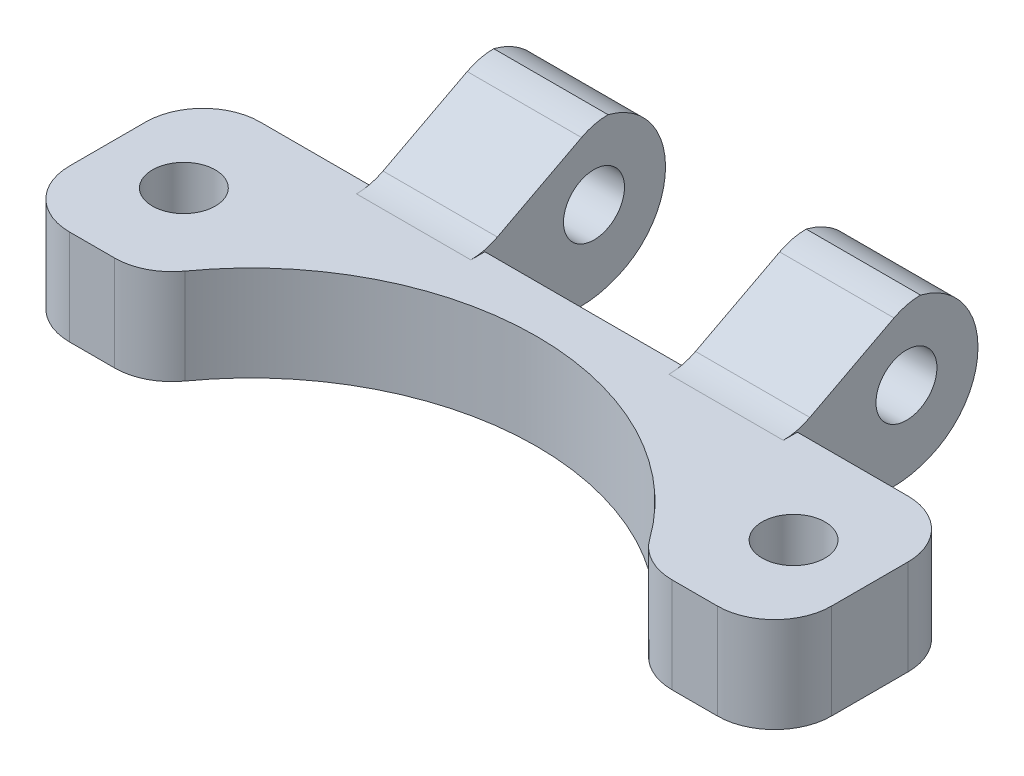
ISO-10303-21;
HEADER;
FILE_DESCRIPTION(('STEP AP214'),'2;1');
FILE_NAME('part.step','',(''),(''),'','','');
FILE_SCHEMA(('AUTOMOTIVE_DESIGN { 1 0 10303 214 1 1 1 1 }'));
ENDSEC;
DATA;
#1=APPLICATION_CONTEXT('core data for automotive mechanical design processes');
#2=APPLICATION_PROTOCOL_DEFINITION('international standard','automotive_design',2000,#1);
#3=PRODUCT_CONTEXT('',#1,'mechanical');
#4=PRODUCT('Part','Part','',(#3));
#5=PRODUCT_RELATED_PRODUCT_CATEGORY('part','',(#4));
#6=PRODUCT_DEFINITION_FORMATION('','',#4);
#7=PRODUCT_DEFINITION_CONTEXT('part definition',#1,'design');
#8=PRODUCT_DEFINITION('design','',#6,#7);
#9=PRODUCT_DEFINITION_SHAPE('','',#8);
#10=(LENGTH_UNIT() NAMED_UNIT(*) SI_UNIT(.MILLI.,.METRE.));
#11=(NAMED_UNIT(*) PLANE_ANGLE_UNIT() SI_UNIT($,.RADIAN.));
#12=(NAMED_UNIT(*) SI_UNIT($,.STERADIAN.) SOLID_ANGLE_UNIT());
#13=UNCERTAINTY_MEASURE_WITH_UNIT(LENGTH_MEASURE(1.E-05),#10,'distance_accuracy_value','');
#14=(GEOMETRIC_REPRESENTATION_CONTEXT(3) GLOBAL_UNCERTAINTY_ASSIGNED_CONTEXT((#13)) GLOBAL_UNIT_ASSIGNED_CONTEXT((#10,
#11,#12)) REPRESENTATION_CONTEXT('',''));
#15=CARTESIAN_POINT('',(0.,0.,0.));
#16=DIRECTION('',(0.,0.,1.));
#17=DIRECTION('',(1.,0.,0.));
#18=AXIS2_PLACEMENT_3D('',#15,#16,#17);
#19=CARTESIAN_POINT('',(-38.8675457158584,5.,2.34427129839153));
#20=DIRECTION('',(0.,0.,-1.));
#21=DIRECTION('',(-1.,0.,0.));
#22=AXIS2_PLACEMENT_3D('',#19,#20,#21);
#23=PLANE('',#22);
#24=DIRECTION('',(1.,0.,0.));
#25=VECTOR('',#24,1.);
#26=CARTESIAN_POINT('',(-38.8675457158584,0.,2.34427129839153));
#27=LINE('',#26,#25);
#28=CARTESIAN_POINT('',(-35.8675457158584,0.,2.34427129839153));
#29=VERTEX_POINT('',#28);
#30=CARTESIAN_POINT('',(-33.4997058898967,0.,2.34427129839153));
#31=VERTEX_POINT('',#30);
#32=EDGE_CURVE('E355',#29,#31,#27,.T.);
#33=ORIENTED_EDGE('',*,*,#32,.T.);
#34=DIRECTION('',(0.,1.,0.));
#35=VECTOR('',#34,1.);
#36=CARTESIAN_POINT('',(-33.4997058898967,5.,2.34427129839153));
#37=LINE('',#36,#35);
#38=CARTESIAN_POINT('',(-33.4997058898967,5.,2.34427129839153));
#39=VERTEX_POINT('',#38);
#40=EDGE_CURVE('E451',#31,#39,#37,.T.);
#41=ORIENTED_EDGE('',*,*,#40,.T.);
#42=DIRECTION('',(1.,0.,0.));
#43=VECTOR('',#42,1.);
#44=CARTESIAN_POINT('',(-38.8675457158584,5.,2.34427129839153));
#45=LINE('',#44,#43);
#46=CARTESIAN_POINT('',(-35.8675457158584,5.,2.34427129839153));
#47=VERTEX_POINT('',#46);
#48=EDGE_CURVE('E368',#47,#39,#45,.T.);
#49=ORIENTED_EDGE('',*,*,#48,.F.);
#50=DIRECTION('',(0.,-1.,0.));
#51=VECTOR('',#50,1.);
#52=CARTESIAN_POINT('',(-35.8675457158584,5.,2.34427129839153));
#53=LINE('',#52,#51);
#54=EDGE_CURVE('E805',#47,#29,#53,.T.);
#55=ORIENTED_EDGE('',*,*,#54,.T.);
#56=EDGE_LOOP('',(#33,#41,#49,#55));
#57=FACE_BOUND('',#56,.T.);
#58=ADVANCED_FACE('F32',(#57),#23,.F.);
#59=CARTESIAN_POINT('',(-38.8675457158584,5.,-7.65572870160847));
#60=DIRECTION('',(0.,0.,1.));
#61=DIRECTION('',(1.,0.,0.));
#62=AXIS2_PLACEMENT_3D('',#59,#60,#61);
#63=PLANE('',#62);
#64=DIRECTION('',(0.,-1.,0.));
#65=VECTOR('',#64,1.);
#66=CARTESIAN_POINT('',(-24.0675457158584,10.,-7.65572870160847));
#67=LINE('',#66,#65);
#68=CARTESIAN_POINT('',(-24.0675457158584,5.,-7.65572870160847));
#69=VERTEX_POINT('',#68);
#70=CARTESIAN_POINT('',(-24.0675457158584,0.,-7.65572870160847));
#71=VERTEX_POINT('',#70);
#72=EDGE_CURVE('E238',#69,#71,#67,.T.);
#73=ORIENTED_EDGE('',*,*,#72,.F.);
#74=DIRECTION('',(-1.,0.,0.));
#75=VECTOR('',#74,1.);
#76=CARTESIAN_POINT('',(-38.8675457158584,5.,-7.65572870160847));
#77=LINE('',#76,#75);
#78=CARTESIAN_POINT('',(-13.6675457158584,5.,-7.65572870160847));
#79=VERTEX_POINT('',#78);
#80=EDGE_CURVE('E364',#79,#69,#77,.T.);
#81=ORIENTED_EDGE('',*,*,#80,.F.);
#82=DIRECTION('',(0.,-1.,0.));
#83=VECTOR('',#82,1.);
#84=CARTESIAN_POINT('',(-13.6675457158584,10.,-7.65572870160847));
#85=LINE('',#84,#83);
#86=CARTESIAN_POINT('',(-13.6675457158584,0.,-7.65572870160847));
#87=VERTEX_POINT('',#86);
#88=EDGE_CURVE('E262',#79,#87,#85,.T.);
#89=ORIENTED_EDGE('',*,*,#88,.T.);
#90=DIRECTION('',(-1.,0.,0.));
#91=VECTOR('',#90,1.);
#92=CARTESIAN_POINT('',(-38.8675457158584,0.,-7.65572870160847));
#93=LINE('',#92,#91);
#94=EDGE_CURVE('E227',#87,#71,#93,.T.);
#95=ORIENTED_EDGE('',*,*,#94,.T.);
#96=EDGE_LOOP('',(#73,#81,#89,#95));
#97=FACE_BOUND('',#96,.T.);
#98=ADVANCED_FACE('F408',(#97),#63,.F.);
#99=CARTESIAN_POINT('',(-30.0675457158584,0.,-7.65572870160847));
#100=VERTEX_POINT('',#99);
#101=CARTESIAN_POINT('',(-35.8675457158584,0.,-7.65572870160847));
#102=VERTEX_POINT('',#101);
#103=EDGE_CURVE('E215',#100,#102,#93,.T.);
#104=ORIENTED_EDGE('',*,*,#103,.T.);
#105=DIRECTION('',(0.,-1.,0.));
#106=VECTOR('',#105,1.);
#107=CARTESIAN_POINT('',(-35.8675457158584,5.,-7.65572870160847));
#108=LINE('',#107,#106);
#109=CARTESIAN_POINT('',(-35.8675457158584,5.,-7.65572870160847));
#110=VERTEX_POINT('',#109);
#111=EDGE_CURVE('E817',#102,#110,#108,.F.);
#112=ORIENTED_EDGE('',*,*,#111,.T.);
#113=CARTESIAN_POINT('',(-30.0675457158584,5.,-7.65572870160847));
#114=VERTEX_POINT('',#113);
#115=EDGE_CURVE('E235',#114,#110,#77,.T.);
#116=ORIENTED_EDGE('',*,*,#115,.F.);
#117=DIRECTION('',(0.,-1.,0.));
#118=VECTOR('',#117,1.);
#119=CARTESIAN_POINT('',(-30.0675457158584,10.,-7.65572870160847));
#120=LINE('',#119,#118);
#121=EDGE_CURVE('E232',#114,#100,#120,.T.);
#122=ORIENTED_EDGE('',*,*,#121,.T.);
#123=EDGE_LOOP('',(#104,#112,#116,#122));
#124=FACE_BOUND('',#123,.T.);
#125=ADVANCED_FACE('F233',(#124),#63,.F.);
#126=CARTESIAN_POINT('',(-1.86754571585838,5.,-7.65572870160847));
#127=VERTEX_POINT('',#126);
#128=CARTESIAN_POINT('',(-7.66754571585837,5.,-7.65572870160847));
#129=VERTEX_POINT('',#128);
#130=EDGE_CURVE('E263',#127,#129,#77,.T.);
#131=ORIENTED_EDGE('',*,*,#130,.F.);
#132=DIRECTION('',(0.,-1.,0.));
#133=VECTOR('',#132,1.);
#134=CARTESIAN_POINT('',(-1.86754571585838,5.,-7.65572870160847));
#135=LINE('',#134,#133);
#136=CARTESIAN_POINT('',(-1.86754571585838,0.,-7.65572870160847));
#137=VERTEX_POINT('',#136);
#138=EDGE_CURVE('E779',#127,#137,#135,.T.);
#139=ORIENTED_EDGE('',*,*,#138,.T.);
#140=CARTESIAN_POINT('',(-7.66754571585837,0.,-7.65572870160847));
#141=VERTEX_POINT('',#140);
#142=EDGE_CURVE('E344',#137,#141,#93,.T.);
#143=ORIENTED_EDGE('',*,*,#142,.T.);
#144=DIRECTION('',(0.,-1.,0.));
#145=VECTOR('',#144,1.);
#146=CARTESIAN_POINT('',(-7.66754571585837,10.,-7.65572870160847));
#147=LINE('',#146,#145);
#148=EDGE_CURVE('E258',#129,#141,#147,.T.);
#149=ORIENTED_EDGE('',*,*,#148,.F.);
#150=EDGE_LOOP('',(#131,#139,#143,#149));
#151=FACE_BOUND('',#150,.T.);
#152=ADVANCED_FACE('F417',(#151),#63,.F.);
#153=CARTESIAN_POINT('',(-38.8675457158584,5.,-7.65572870160847));
#154=DIRECTION('',(1.,0.,0.));
#155=DIRECTION('',(0.,0.,-1.));
#156=AXIS2_PLACEMENT_3D('',#153,#154,#155);
#157=PLANE('',#156);
#158=DIRECTION('',(0.,0.,1.));
#159=VECTOR('',#158,1.);
#160=CARTESIAN_POINT('',(-38.8675457158584,5.,-7.65572870160847));
#161=LINE('',#160,#159);
#162=CARTESIAN_POINT('',(-38.8675457158584,5.,-4.65572870160847));
#163=VERTEX_POINT('',#162);
#164=CARTESIAN_POINT('',(-38.8675457158584,5.,-0.655728701608466));
#165=VERTEX_POINT('',#164);
#166=EDGE_CURVE('E346',#163,#165,#161,.T.);
#167=ORIENTED_EDGE('',*,*,#166,.F.);
#168=DIRECTION('',(0.,-1.,0.));
#169=VECTOR('',#168,1.);
#170=CARTESIAN_POINT('',(-38.8675457158584,5.,-4.65572870160847));
#171=LINE('',#170,#169);
#172=CARTESIAN_POINT('',(-38.8675457158584,0.,-4.65572870160847));
#173=VERTEX_POINT('',#172);
#174=EDGE_CURVE('E340',#163,#173,#171,.T.);
#175=ORIENTED_EDGE('',*,*,#174,.T.);
#176=DIRECTION('',(0.,0.,1.));
#177=VECTOR('',#176,1.);
#178=CARTESIAN_POINT('',(-38.8675457158584,0.,-7.65572870160847));
#179=LINE('',#178,#177);
#180=CARTESIAN_POINT('',(-38.8675457158584,0.,-0.655728701608466));
#181=VERTEX_POINT('',#180);
#182=EDGE_CURVE('E359',#173,#181,#179,.T.);
#183=ORIENTED_EDGE('',*,*,#182,.T.);
#184=DIRECTION('',(0.,-1.,0.));
#185=VECTOR('',#184,1.);
#186=CARTESIAN_POINT('',(-38.8675457158584,5.,-0.655728701608466));
#187=LINE('',#186,#185);
#188=EDGE_CURVE('E338',#181,#165,#187,.F.);
#189=ORIENTED_EDGE('',*,*,#188,.T.);
#190=EDGE_LOOP('',(#167,#175,#183,#189));
#191=FACE_BOUND('',#190,.T.);
#192=ADVANCED_FACE('F421',(#191),#157,.F.);
#193=CARTESIAN_POINT('',(-4.23538554182007,5.,2.34427129839153));
#194=VERTEX_POINT('',#193);
#195=CARTESIAN_POINT('',(-1.86754571585838,5.,2.34427129839153));
#196=VERTEX_POINT('',#195);
#197=EDGE_CURVE('E371',#194,#196,#45,.T.);
#198=ORIENTED_EDGE('',*,*,#197,.F.);
#199=DIRECTION('',(0.,1.,0.));
#200=VECTOR('',#199,1.);
#201=CARTESIAN_POINT('',(-4.23538554182007,5.,2.34427129839153));
#202=LINE('',#201,#200);
#203=CARTESIAN_POINT('',(-4.23538554182007,0.,2.34427129839153));
#204=VERTEX_POINT('',#203);
#205=EDGE_CURVE('E432',#194,#204,#202,.F.);
#206=ORIENTED_EDGE('',*,*,#205,.T.);
#207=CARTESIAN_POINT('',(-1.86754571585838,0.,2.34427129839153));
#208=VERTEX_POINT('',#207);
#209=EDGE_CURVE('E358',#204,#208,#27,.T.);
#210=ORIENTED_EDGE('',*,*,#209,.T.);
#211=DIRECTION('',(0.,-1.,0.));
#212=VECTOR('',#211,1.);
#213=CARTESIAN_POINT('',(-1.86754571585838,5.,2.34427129839153));
#214=LINE('',#213,#212);
#215=EDGE_CURVE('E434',#208,#196,#214,.F.);
#216=ORIENTED_EDGE('',*,*,#215,.T.);
#217=EDGE_LOOP('',(#198,#206,#210,#216));
#218=FACE_BOUND('',#217,.T.);
#219=ADVANCED_FACE('F411',(#218),#23,.F.);
#220=CARTESIAN_POINT('',(1.13245428414162,5.,-7.65572870160847));
#221=DIRECTION('',(-1.,0.,0.));
#222=DIRECTION('',(0.,0.,1.));
#223=AXIS2_PLACEMENT_3D('',#220,#221,#222);
#224=PLANE('',#223);
#225=DIRECTION('',(0.,0.,-1.));
#226=VECTOR('',#225,1.);
#227=CARTESIAN_POINT('',(1.13245428414162,5.,-7.65572870160847));
#228=LINE('',#227,#226);
#229=CARTESIAN_POINT('',(1.13245428414162,5.,-0.655728701608466));
#230=VERTEX_POINT('',#229);
#231=CARTESIAN_POINT('',(1.13245428414162,5.,-4.65572870160847));
#232=VERTEX_POINT('',#231);
#233=EDGE_CURVE('E365',#230,#232,#228,.T.);
#234=ORIENTED_EDGE('',*,*,#233,.F.);
#235=DIRECTION('',(0.,-1.,0.));
#236=VECTOR('',#235,1.);
#237=CARTESIAN_POINT('',(1.13245428414162,5.,-0.655728701608466));
#238=LINE('',#237,#236);
#239=CARTESIAN_POINT('',(1.13245428414162,0.,-0.655728701608466));
#240=VERTEX_POINT('',#239);
#241=EDGE_CURVE('E786',#230,#240,#238,.T.);
#242=ORIENTED_EDGE('',*,*,#241,.T.);
#243=DIRECTION('',(0.,0.,-1.));
#244=VECTOR('',#243,1.);
#245=CARTESIAN_POINT('',(1.13245428414162,0.,-7.65572870160847));
#246=LINE('',#245,#244);
#247=CARTESIAN_POINT('',(1.13245428414162,0.,-4.65572870160847));
#248=VERTEX_POINT('',#247);
#249=EDGE_CURVE('E228',#240,#248,#246,.T.);
#250=ORIENTED_EDGE('',*,*,#249,.T.);
#251=DIRECTION('',(0.,-1.,0.));
#252=VECTOR('',#251,1.);
#253=CARTESIAN_POINT('',(1.13245428414162,5.,-4.65572870160847));
#254=LINE('',#253,#252);
#255=EDGE_CURVE('E791',#248,#232,#254,.F.);
#256=ORIENTED_EDGE('',*,*,#255,.T.);
#257=EDGE_LOOP('',(#234,#242,#250,#256));
#258=FACE_BOUND('',#257,.T.);
#259=ADVANCED_FACE('F389',(#258),#224,.F.);
#260=CARTESIAN_POINT('',(0.,5.,0.));
#261=DIRECTION('',(0.,1.,0.));
#262=DIRECTION('',(0.,0.,1.));
#263=AXIS2_PLACEMENT_3D('',#260,#261,#262);
#264=PLANE('',#263);
#265=CARTESIAN_POINT('',(-18.8675457158584,5.,9.82758607193942));
#266=DIRECTION('',(0.,1.,0.));
#267=DIRECTION('',(0.,0.,-1.));
#268=AXIS2_PLACEMENT_3D('',#265,#266,#267);
#269=CIRCLE('',#268,15.);
#270=CARTESIAN_POINT('',(-6.67407890415979,5.,1.09149042731618));
#271=VERTEX_POINT('',#270);
#272=CARTESIAN_POINT('',(-31.061012527557,5.,1.09149042731618));
#273=VERTEX_POINT('',#272);
#274=EDGE_CURVE('E511',#271,#273,#269,.T.);
#275=ORIENTED_EDGE('',*,*,#274,.F.);
#276=CARTESIAN_POINT('',(-4.23538554182007,5.,-0.655728701608467));
#277=DIRECTION('',(0.,1.,0.));
#278=DIRECTION('',(0.,0.,1.));
#279=AXIS2_PLACEMENT_3D('',#276,#277,#278);
#280=CIRCLE('',#279,3.);
#281=EDGE_CURVE('E440',#271,#194,#280,.T.);
#282=ORIENTED_EDGE('',*,*,#281,.T.);
#283=ORIENTED_EDGE('',*,*,#197,.T.);
#284=CARTESIAN_POINT('',(-1.86754571585838,5.,-0.655728701608466));
#285=DIRECTION('',(0.,1.,0.));
#286=DIRECTION('',(0.,0.,1.));
#287=AXIS2_PLACEMENT_3D('',#284,#285,#286);
#288=CIRCLE('',#287,3.);
#289=EDGE_CURVE('E814',#196,#230,#288,.T.);
#290=ORIENTED_EDGE('',*,*,#289,.T.);
#291=ORIENTED_EDGE('',*,*,#233,.T.);
#292=CARTESIAN_POINT('',(-1.86754571585838,5.,-4.65572870160847));
#293=DIRECTION('',(0.,1.,0.));
#294=DIRECTION('',(0.,0.,1.));
#295=AXIS2_PLACEMENT_3D('',#292,#293,#294);
#296=CIRCLE('',#295,3.);
#297=EDGE_CURVE('E784',#232,#127,#296,.T.);
#298=ORIENTED_EDGE('',*,*,#297,.T.);
#299=ORIENTED_EDGE('',*,*,#130,.T.);
#300=DIRECTION('',(0.,0.,1.));
#301=VECTOR('',#300,1.);
#302=CARTESIAN_POINT('',(-7.66754571585837,5.,0.));
#303=LINE('',#302,#301);
#304=CARTESIAN_POINT('',(-7.66754571585837,5.,-6.91732209208745));
#305=VERTEX_POINT('',#304);
#306=EDGE_CURVE('E318',#129,#305,#303,.T.);
#307=ORIENTED_EDGE('',*,*,#306,.T.);
#308=DIRECTION('',(-1.,0.,0.));
#309=VECTOR('',#308,1.);
#310=CARTESIAN_POINT('',(0.,5.,-6.91732209208745));
#311=LINE('',#310,#309);
#312=CARTESIAN_POINT('',(-13.6675457158584,5.,-6.91732209208745));
#313=VERTEX_POINT('',#312);
#314=EDGE_CURVE('E321',#305,#313,#311,.T.);
#315=ORIENTED_EDGE('',*,*,#314,.T.);
#316=DIRECTION('',(0.,0.,-1.));
#317=VECTOR('',#316,1.);
#318=CARTESIAN_POINT('',(-13.6675457158584,5.,0.));
#319=LINE('',#318,#317);
#320=EDGE_CURVE('E324',#313,#79,#319,.T.);
#321=ORIENTED_EDGE('',*,*,#320,.T.);
#322=ORIENTED_EDGE('',*,*,#80,.T.);
#323=DIRECTION('',(0.,0.,1.));
#324=VECTOR('',#323,1.);
#325=CARTESIAN_POINT('',(-24.0675457158584,5.,0.));
#326=LINE('',#325,#324);
#327=CARTESIAN_POINT('',(-24.0675457158584,5.,-6.91732209208745));
#328=VERTEX_POINT('',#327);
#329=EDGE_CURVE('E310',#69,#328,#326,.T.);
#330=ORIENTED_EDGE('',*,*,#329,.T.);
#331=DIRECTION('',(-1.,0.,0.));
#332=VECTOR('',#331,1.);
#333=CARTESIAN_POINT('',(0.,5.,-6.91732209208745));
#334=LINE('',#333,#332);
#335=CARTESIAN_POINT('',(-30.0675457158584,5.,-6.91732209208745));
#336=VERTEX_POINT('',#335);
#337=EDGE_CURVE('E313',#328,#336,#334,.T.);
#338=ORIENTED_EDGE('',*,*,#337,.T.);
#339=DIRECTION('',(0.,0.,-1.));
#340=VECTOR('',#339,1.);
#341=CARTESIAN_POINT('',(-30.0675457158584,5.,0.));
#342=LINE('',#341,#340);
#343=EDGE_CURVE('E316',#336,#114,#342,.T.);
#344=ORIENTED_EDGE('',*,*,#343,.T.);
#345=ORIENTED_EDGE('',*,*,#115,.T.);
#346=CARTESIAN_POINT('',(-35.8675457158584,5.,-4.65572870160847));
#347=DIRECTION('',(0.,1.,0.));
#348=DIRECTION('',(0.,0.,1.));
#349=AXIS2_PLACEMENT_3D('',#346,#347,#348);
#350=CIRCLE('',#349,3.);
#351=EDGE_CURVE('E808',#110,#163,#350,.T.);
#352=ORIENTED_EDGE('',*,*,#351,.T.);
#353=ORIENTED_EDGE('',*,*,#166,.T.);
#354=CARTESIAN_POINT('',(-35.8675457158584,5.,-0.655728701608466));
#355=DIRECTION('',(0.,1.,0.));
#356=DIRECTION('',(0.,0.,1.));
#357=AXIS2_PLACEMENT_3D('',#354,#355,#356);
#358=CIRCLE('',#357,3.);
#359=EDGE_CURVE('E812',#165,#47,#358,.T.);
#360=ORIENTED_EDGE('',*,*,#359,.T.);
#361=ORIENTED_EDGE('',*,*,#48,.T.);
#362=CARTESIAN_POINT('',(-33.4997058898967,5.,-0.655728701608467));
#363=DIRECTION('',(0.,1.,0.));
#364=DIRECTION('',(0.,0.,1.));
#365=AXIS2_PLACEMENT_3D('',#362,#363,#364);
#366=CIRCLE('',#365,3.);
#367=EDGE_CURVE('E446',#39,#273,#366,.T.);
#368=ORIENTED_EDGE('',*,*,#367,.T.);
#369=EDGE_LOOP('',(#275,#282,#283,#290,#291,#298,#299,#307,#315,#321,#322,#330,#338,#344,#345,
#352,#353,#360,#361,#368));
#370=FACE_BOUND('',#369,.T.);
#371=CARTESIAN_POINT('',(-2.86754571585837,5.,-2.65572870160847));
#372=DIRECTION('',(0.,1.,0.));
#373=DIRECTION('',(0.,0.,1.));
#374=AXIS2_PLACEMENT_3D('',#371,#372,#373);
#375=CIRCLE('',#374,1.65);
#376=CARTESIAN_POINT('',(-2.86754571585837,5.,-1.00572870160847));
#377=VERTEX_POINT('',#376);
#378=EDGE_CURVE('E275',#377,#377,#375,.T.);
#379=ORIENTED_EDGE('',*,*,#378,.F.);
#380=EDGE_LOOP('',(#379));
#381=FACE_BOUND('',#380,.T.);
#382=CARTESIAN_POINT('',(-34.8675457158584,5.,-2.65572870160847));
#383=DIRECTION('',(0.,1.,0.));
#384=DIRECTION('',(0.,0.,1.));
#385=AXIS2_PLACEMENT_3D('',#382,#383,#384);
#386=CIRCLE('',#385,1.65);
#387=CARTESIAN_POINT('',(-34.8675457158584,5.,-1.00572870160846));
#388=VERTEX_POINT('',#387);
#389=EDGE_CURVE('E376',#388,#388,#386,.T.);
#390=ORIENTED_EDGE('',*,*,#389,.F.);
#391=EDGE_LOOP('',(#390));
#392=FACE_BOUND('',#391,.T.);
#393=ADVANCED_FACE('F386',(#370,#381,#392),#264,.T.);
#394=CARTESIAN_POINT('',(0.,0.,0.));
#395=DIRECTION('',(0.,1.,0.));
#396=DIRECTION('',(0.,0.,1.));
#397=AXIS2_PLACEMENT_3D('',#394,#395,#396);
#398=PLANE('',#397);
#399=CARTESIAN_POINT('',(-2.86754571585837,0.,-2.65572870160847));
#400=DIRECTION('',(0.,1.,0.));
#401=DIRECTION('',(0.,0.,1.));
#402=AXIS2_PLACEMENT_3D('',#399,#400,#401);
#403=CIRCLE('',#402,1.65);
#404=CARTESIAN_POINT('',(-2.86754571585837,0.,-1.00572870160847));
#405=VERTEX_POINT('',#404);
#406=EDGE_CURVE('E379',#405,#405,#403,.F.);
#407=ORIENTED_EDGE('',*,*,#406,.F.);
#408=EDGE_LOOP('',(#407));
#409=FACE_BOUND('',#408,.T.);
#410=CARTESIAN_POINT('',(-34.8675457158584,0.,-2.65572870160847));
#411=DIRECTION('',(0.,1.,0.));
#412=DIRECTION('',(0.,0.,1.));
#413=AXIS2_PLACEMENT_3D('',#410,#411,#412);
#414=CIRCLE('',#413,1.65);
#415=CARTESIAN_POINT('',(-34.8675457158584,0.,-1.00572870160846));
#416=VERTEX_POINT('',#415);
#417=EDGE_CURVE('E362',#416,#416,#414,.F.);
#418=ORIENTED_EDGE('',*,*,#417,.F.);
#419=EDGE_LOOP('',(#418));
#420=FACE_BOUND('',#419,.T.);
#421=ORIENTED_EDGE('',*,*,#209,.F.);
#422=CARTESIAN_POINT('',(-4.23538554182007,0.,-0.655728701608467));
#423=DIRECTION('',(0.,1.,0.));
#424=DIRECTION('',(0.,0.,1.));
#425=AXIS2_PLACEMENT_3D('',#422,#423,#424);
#426=CIRCLE('',#425,3.);
#427=CARTESIAN_POINT('',(-6.67407890415979,0.,1.09149042731618));
#428=VERTEX_POINT('',#427);
#429=EDGE_CURVE('E442',#204,#428,#426,.F.);
#430=ORIENTED_EDGE('',*,*,#429,.T.);
#431=CARTESIAN_POINT('',(-18.8675457158584,0.,9.82758607193942));
#432=DIRECTION('',(0.,1.,0.));
#433=DIRECTION('',(0.,0.,1.));
#434=AXIS2_PLACEMENT_3D('',#431,#432,#433);
#435=CIRCLE('',#434,15.);
#436=CARTESIAN_POINT('',(-31.061012527557,0.,1.09149042731618));
#437=VERTEX_POINT('',#436);
#438=EDGE_CURVE('E516',#437,#428,#435,.F.);
#439=ORIENTED_EDGE('',*,*,#438,.F.);
#440=CARTESIAN_POINT('',(-33.4997058898967,0.,-0.655728701608467));
#441=DIRECTION('',(0.,1.,0.));
#442=DIRECTION('',(0.,0.,1.));
#443=AXIS2_PLACEMENT_3D('',#440,#441,#442);
#444=CIRCLE('',#443,3.);
#445=EDGE_CURVE('E443',#437,#31,#444,.F.);
#446=ORIENTED_EDGE('',*,*,#445,.T.);
#447=ORIENTED_EDGE('',*,*,#32,.F.);
#448=CARTESIAN_POINT('',(-35.8675457158584,0.,-0.655728701608466));
#449=DIRECTION('',(0.,1.,0.));
#450=DIRECTION('',(0.,0.,1.));
#451=AXIS2_PLACEMENT_3D('',#448,#449,#450);
#452=CIRCLE('',#451,3.);
#453=EDGE_CURVE('E820',#29,#181,#452,.F.);
#454=ORIENTED_EDGE('',*,*,#453,.T.);
#455=ORIENTED_EDGE('',*,*,#182,.F.);
#456=CARTESIAN_POINT('',(-35.8675457158584,0.,-4.65572870160847));
#457=DIRECTION('',(0.,1.,0.));
#458=DIRECTION('',(0.,0.,1.));
#459=AXIS2_PLACEMENT_3D('',#456,#457,#458);
#460=CIRCLE('',#459,3.);
#461=EDGE_CURVE('E224',#173,#102,#460,.F.);
#462=ORIENTED_EDGE('',*,*,#461,.T.);
#463=ORIENTED_EDGE('',*,*,#103,.F.);
#464=DIRECTION('',(0.,0.,-1.));
#465=VECTOR('',#464,1.);
#466=CARTESIAN_POINT('',(-30.0675457158584,0.,-7.65572870160847));
#467=LINE('',#466,#465);
#468=CARTESIAN_POINT('',(-30.0675457158584,0.,-12.6557287016085));
#469=VERTEX_POINT('',#468);
#470=EDGE_CURVE('E221',#100,#469,#467,.T.);
#471=ORIENTED_EDGE('',*,*,#470,.T.);
#472=DIRECTION('',(1.,0.,0.));
#473=VECTOR('',#472,1.);
#474=CARTESIAN_POINT('',(0.,0.,-12.6557287016085));
#475=LINE('',#474,#473);
#476=CARTESIAN_POINT('',(-24.0675457158584,0.,-12.6557287016085));
#477=VERTEX_POINT('',#476);
#478=EDGE_CURVE('E279',#469,#477,#475,.T.);
#479=ORIENTED_EDGE('',*,*,#478,.T.);
#480=DIRECTION('',(0.,0.,1.));
#481=VECTOR('',#480,1.);
#482=CARTESIAN_POINT('',(-24.0675457158584,0.,-17.6557287016085));
#483=LINE('',#482,#481);
#484=EDGE_CURVE('E242',#477,#71,#483,.T.);
#485=ORIENTED_EDGE('',*,*,#484,.T.);
#486=ORIENTED_EDGE('',*,*,#94,.F.);
#487=DIRECTION('',(0.,0.,-1.));
#488=VECTOR('',#487,1.);
#489=CARTESIAN_POINT('',(-13.6675457158584,0.,-7.65572870160847));
#490=LINE('',#489,#488);
#491=CARTESIAN_POINT('',(-13.6675457158584,0.,-12.6557287016085));
#492=VERTEX_POINT('',#491);
#493=EDGE_CURVE('E237',#87,#492,#490,.T.);
#494=ORIENTED_EDGE('',*,*,#493,.T.);
#495=DIRECTION('',(1.,0.,0.));
#496=VECTOR('',#495,1.);
#497=CARTESIAN_POINT('',(0.,0.,-12.6557287016085));
#498=LINE('',#497,#496);
#499=CARTESIAN_POINT('',(-7.66754571585837,0.,-12.6557287016085));
#500=VERTEX_POINT('',#499);
#501=EDGE_CURVE('E266',#492,#500,#498,.T.);
#502=ORIENTED_EDGE('',*,*,#501,.T.);
#503=DIRECTION('',(0.,0.,1.));
#504=VECTOR('',#503,1.);
#505=CARTESIAN_POINT('',(-7.66754571585837,0.,-17.6557287016085));
#506=LINE('',#505,#504);
#507=EDGE_CURVE('E271',#500,#141,#506,.T.);
#508=ORIENTED_EDGE('',*,*,#507,.T.);
#509=ORIENTED_EDGE('',*,*,#142,.F.);
#510=CARTESIAN_POINT('',(-1.86754571585838,0.,-4.65572870160847));
#511=DIRECTION('',(0.,1.,0.));
#512=DIRECTION('',(0.,0.,1.));
#513=AXIS2_PLACEMENT_3D('',#510,#511,#512);
#514=CIRCLE('',#513,3.);
#515=EDGE_CURVE('E343',#137,#248,#514,.F.);
#516=ORIENTED_EDGE('',*,*,#515,.T.);
#517=ORIENTED_EDGE('',*,*,#249,.F.);
#518=CARTESIAN_POINT('',(-1.86754571585838,0.,-0.655728701608466));
#519=DIRECTION('',(0.,1.,0.));
#520=DIRECTION('',(0.,0.,1.));
#521=AXIS2_PLACEMENT_3D('',#518,#519,#520);
#522=CIRCLE('',#521,3.);
#523=EDGE_CURVE('E821',#240,#208,#522,.F.);
#524=ORIENTED_EDGE('',*,*,#523,.T.);
#525=EDGE_LOOP('',(#421,#430,#439,#446,#447,#454,#455,#462,#463,#471,#479,#485,#486,#494,#502,
#508,#509,#516,#517,#524));
#526=FACE_BOUND('',#525,.T.);
#527=ADVANCED_FACE('F218',(#409,#420,#526),#398,.F.);
#528=CARTESIAN_POINT('',(-34.8675457158584,-4.66690475583121,-2.65572870160847));
#529=DIRECTION('',(0.,1.,0.));
#530=DIRECTION('',(0.,0.,1.));
#531=AXIS2_PLACEMENT_3D('',#528,#529,#530);
#532=CYLINDRICAL_SURFACE('',#531,1.65);
#533=ORIENTED_EDGE('',*,*,#417,.T.);
#534=EDGE_LOOP('',(#533));
#535=FACE_BOUND('',#534,.T.);
#536=ORIENTED_EDGE('',*,*,#389,.T.);
#537=EDGE_LOOP('',(#536));
#538=FACE_BOUND('',#537,.T.);
#539=ADVANCED_FACE('F394',(#535,#538),#532,.F.);
#540=CARTESIAN_POINT('',(-2.86754571585837,-4.66690475583121,-2.65572870160847));
#541=DIRECTION('',(0.,1.,0.));
#542=DIRECTION('',(0.,0.,1.));
#543=AXIS2_PLACEMENT_3D('',#540,#541,#542);
#544=CYLINDRICAL_SURFACE('',#543,1.65);
#545=ORIENTED_EDGE('',*,*,#406,.T.);
#546=EDGE_LOOP('',(#545));
#547=FACE_BOUND('',#546,.T.);
#548=ORIENTED_EDGE('',*,*,#378,.T.);
#549=EDGE_LOOP('',(#548));
#550=FACE_BOUND('',#549,.T.);
#551=ADVANCED_FACE('F384',(#547,#550),#544,.F.);
#552=CARTESIAN_POINT('',(-7.66754571585837,10.,-17.6557287016085));
#553=DIRECTION('',(-1.,0.,0.));
#554=DIRECTION('',(0.,0.,1.));
#555=AXIS2_PLACEMENT_3D('',#552,#553,#554);
#556=PLANE('',#555);
#557=CARTESIAN_POINT('',(-7.66754571585837,4.275,-13.3807287016085));
#558=DIRECTION('',(1.,0.,0.));
#559=DIRECTION('',(0.,0.,-1.));
#560=AXIS2_PLACEMENT_3D('',#557,#558,#559);
#561=CIRCLE('',#560,1.6);
#562=CARTESIAN_POINT('',(-7.66754571585837,4.275,-14.9807287016085));
#563=VERTEX_POINT('',#562);
#564=EDGE_CURVE('E522',#563,#563,#561,.T.);
#565=ORIENTED_EDGE('',*,*,#564,.F.);
#566=EDGE_LOOP('',(#565));
#567=FACE_BOUND('',#566,.T.);
#568=CARTESIAN_POINT('',(-7.66754571585837,5.,-12.6557287016085));
#569=DIRECTION('',(-1.,0.,0.));
#570=DIRECTION('',(0.,0.,1.));
#571=AXIS2_PLACEMENT_3D('',#568,#569,#570);
#572=CIRCLE('',#571,5.);
#573=CARTESIAN_POINT('',(-7.66754571585837,0.613789506658476,-15.0559698370156));
#574=VERTEX_POINT('',#573);
#575=EDGE_CURVE('E285',#500,#574,#572,.F.);
#576=ORIENTED_EDGE('',*,*,#575,.T.);
#577=CARTESIAN_POINT('',(-7.66754571585837,4.1227579013317,-13.1357769286899));
#578=DIRECTION('',(-1.,0.,0.));
#579=DIRECTION('',(0.,0.,1.));
#580=AXIS2_PLACEMENT_3D('',#577,#578,#579);
#581=CIRCLE('',#580,4.);
#582=CARTESIAN_POINT('',(-7.66754571585837,8.,-14.1191353111295));
#583=VERTEX_POINT('',#582);
#584=EDGE_CURVE('E457',#574,#583,#581,.F.);
#585=ORIENTED_EDGE('',*,*,#584,.T.);
#586=CARTESIAN_POINT('',(-7.66754571585837,5.,-14.1191353111295));
#587=DIRECTION('',(-1.,0.,0.));
#588=DIRECTION('',(0.,0.,1.));
#589=AXIS2_PLACEMENT_3D('',#586,#587,#588);
#590=CIRCLE('',#589,3.);
#591=CARTESIAN_POINT('',(-7.66754571585837,7.65726745006265,-12.7266807521447));
#592=VERTEX_POINT('',#591);
#593=EDGE_CURVE('E293',#583,#592,#590,.F.);
#594=ORIENTED_EDGE('',*,*,#593,.T.);
#595=DIRECTION('',(0.,0.464151519661598,-0.88575581668755));
#596=VECTOR('',#595,1.);
#597=CARTESIAN_POINT('',(-7.66754571585837,5.,-7.65572870160847));
#598=LINE('',#597,#596);
#599=CARTESIAN_POINT('',(-7.66754571585837,5.34273254993735,-8.30977665107224));
#600=VERTEX_POINT('',#599);
#601=EDGE_CURVE('E508',#600,#592,#598,.T.);
#602=ORIENTED_EDGE('',*,*,#601,.F.);
#603=CARTESIAN_POINT('',(-7.66754571585837,8.,-6.91732209208745));
#604=DIRECTION('',(-1.,0.,0.));
#605=DIRECTION('',(0.,0.,1.));
#606=AXIS2_PLACEMENT_3D('',#603,#604,#605);
#607=CIRCLE('',#606,3.);
#608=EDGE_CURVE('E332',#600,#305,#607,.T.);
#609=ORIENTED_EDGE('',*,*,#608,.T.);
#610=ORIENTED_EDGE('',*,*,#306,.F.);
#611=ORIENTED_EDGE('',*,*,#148,.T.);
#612=ORIENTED_EDGE('',*,*,#507,.F.);
#613=EDGE_LOOP('',(#576,#585,#594,#602,#609,#610,#611,#612));
#614=FACE_BOUND('',#613,.T.);
#615=ADVANCED_FACE('F402',(#567,#614),#556,.F.);
#616=CARTESIAN_POINT('',(-13.6675457158584,10.,-7.65572870160847));
#617=DIRECTION('',(1.,0.,0.));
#618=DIRECTION('',(0.,0.,-1.));
#619=AXIS2_PLACEMENT_3D('',#616,#617,#618);
#620=PLANE('',#619);
#621=CARTESIAN_POINT('',(-13.6675457158584,4.275,-13.3807287016085));
#622=DIRECTION('',(1.,0.,0.));
#623=DIRECTION('',(0.,0.,-1.));
#624=AXIS2_PLACEMENT_3D('',#621,#622,#623);
#625=CIRCLE('',#624,1.6);
#626=CARTESIAN_POINT('',(-13.6675457158584,4.275,-14.9807287016085));
#627=VERTEX_POINT('',#626);
#628=EDGE_CURVE('E243',#627,#627,#625,.T.);
#629=ORIENTED_EDGE('',*,*,#628,.T.);
#630=EDGE_LOOP('',(#629));
#631=FACE_BOUND('',#630,.T.);
#632=CARTESIAN_POINT('',(-13.6675457158584,5.,-14.1191353111295));
#633=DIRECTION('',(1.,0.,0.));
#634=DIRECTION('',(0.,0.,-1.));
#635=AXIS2_PLACEMENT_3D('',#632,#633,#634);
#636=CIRCLE('',#635,3.);
#637=CARTESIAN_POINT('',(-13.6675457158584,7.65726745006265,-12.7266807521447));
#638=VERTEX_POINT('',#637);
#639=CARTESIAN_POINT('',(-13.6675457158584,8.,-14.1191353111295));
#640=VERTEX_POINT('',#639);
#641=EDGE_CURVE('E299',#638,#640,#636,.F.);
#642=ORIENTED_EDGE('',*,*,#641,.T.);
#643=CARTESIAN_POINT('',(-13.6675457158584,4.1227579013317,-13.1357769286899));
#644=DIRECTION('',(1.,0.,0.));
#645=DIRECTION('',(0.,0.,-1.));
#646=AXIS2_PLACEMENT_3D('',#643,#644,#645);
#647=CIRCLE('',#646,4.);
#648=CARTESIAN_POINT('',(-13.6675457158584,0.613789506658476,-15.0559698370156));
#649=VERTEX_POINT('',#648);
#650=EDGE_CURVE('E459',#640,#649,#647,.F.);
#651=ORIENTED_EDGE('',*,*,#650,.T.);
#652=CARTESIAN_POINT('',(-13.6675457158584,5.,-12.6557287016085));
#653=DIRECTION('',(1.,0.,0.));
#654=DIRECTION('',(0.,0.,-1.));
#655=AXIS2_PLACEMENT_3D('',#652,#653,#654);
#656=CIRCLE('',#655,5.);
#657=EDGE_CURVE('E288',#649,#492,#656,.F.);
#658=ORIENTED_EDGE('',*,*,#657,.T.);
#659=ORIENTED_EDGE('',*,*,#493,.F.);
#660=ORIENTED_EDGE('',*,*,#88,.F.);
#661=ORIENTED_EDGE('',*,*,#320,.F.);
#662=CARTESIAN_POINT('',(-13.6675457158584,8.,-6.91732209208745));
#663=DIRECTION('',(1.,0.,0.));
#664=DIRECTION('',(0.,0.,-1.));
#665=AXIS2_PLACEMENT_3D('',#662,#663,#664);
#666=CIRCLE('',#665,3.);
#667=CARTESIAN_POINT('',(-13.6675457158584,5.34273254993735,-8.30977665107224));
#668=VERTEX_POINT('',#667);
#669=EDGE_CURVE('E330',#313,#668,#666,.T.);
#670=ORIENTED_EDGE('',*,*,#669,.T.);
#671=DIRECTION('',(0.,0.464151519661598,-0.88575581668755));
#672=VECTOR('',#671,1.);
#673=CARTESIAN_POINT('',(-13.6675457158584,6.07718316602085,-9.7113532434316));
#674=LINE('',#673,#672);
#675=EDGE_CURVE('E506',#668,#638,#674,.T.);
#676=ORIENTED_EDGE('',*,*,#675,.T.);
#677=EDGE_LOOP('',(#642,#651,#658,#659,#660,#661,#670,#676));
#678=FACE_BOUND('',#677,.T.);
#679=ADVANCED_FACE('F485',(#631,#678),#620,.F.);
#680=CARTESIAN_POINT('',(-24.0675457158584,10.,-17.6557287016085));
#681=DIRECTION('',(-1.,0.,0.));
#682=DIRECTION('',(0.,0.,1.));
#683=AXIS2_PLACEMENT_3D('',#680,#681,#682);
#684=PLANE('',#683);
#685=CARTESIAN_POINT('',(-24.0675457158584,4.275,-13.3807287016085));
#686=DIRECTION('',(-1.,0.,0.));
#687=DIRECTION('',(0.,0.,1.));
#688=AXIS2_PLACEMENT_3D('',#685,#686,#687);
#689=CIRCLE('',#688,1.6);
#690=CARTESIAN_POINT('',(-24.0675457158584,4.275,-11.7807287016085));
#691=VERTEX_POINT('',#690);
#692=EDGE_CURVE('E247',#691,#691,#689,.T.);
#693=ORIENTED_EDGE('',*,*,#692,.T.);
#694=EDGE_LOOP('',(#693));
#695=FACE_BOUND('',#694,.T.);
#696=CARTESIAN_POINT('',(-24.0675457158584,5.,-12.6557287016085));
#697=DIRECTION('',(-1.,0.,0.));
#698=DIRECTION('',(0.,0.,1.));
#699=AXIS2_PLACEMENT_3D('',#696,#697,#698);
#700=CIRCLE('',#699,5.);
#701=CARTESIAN_POINT('',(-24.0675457158584,0.613789506658476,-15.0559698370156));
#702=VERTEX_POINT('',#701);
#703=EDGE_CURVE('E281',#477,#702,#700,.F.);
#704=ORIENTED_EDGE('',*,*,#703,.T.);
#705=CARTESIAN_POINT('',(-24.0675457158584,4.1227579013317,-13.1357769286899));
#706=DIRECTION('',(-1.,0.,0.));
#707=DIRECTION('',(0.,0.,1.));
#708=AXIS2_PLACEMENT_3D('',#705,#706,#707);
#709=CIRCLE('',#708,4.);
#710=CARTESIAN_POINT('',(-24.0675457158584,8.,-14.1191353111295));
#711=VERTEX_POINT('',#710);
#712=EDGE_CURVE('E40',#702,#711,#709,.F.);
#713=ORIENTED_EDGE('',*,*,#712,.T.);
#714=CARTESIAN_POINT('',(-24.0675457158584,5.,-14.1191353111295));
#715=DIRECTION('',(-1.,0.,0.));
#716=DIRECTION('',(0.,0.,1.));
#717=AXIS2_PLACEMENT_3D('',#714,#715,#716);
#718=CIRCLE('',#717,3.);
#719=CARTESIAN_POINT('',(-24.0675457158584,7.65726745006265,-12.7266807521447));
#720=VERTEX_POINT('',#719);
#721=EDGE_CURVE('E303',#711,#720,#718,.F.);
#722=ORIENTED_EDGE('',*,*,#721,.T.);
#723=DIRECTION('',(0.,-0.464151519661598,0.88575581668755));
#724=VECTOR('',#723,1.);
#725=CARTESIAN_POINT('',(-24.0675457158584,10.1884322496671,-17.5569869113899));
#726=LINE('',#725,#724);
#727=CARTESIAN_POINT('',(-24.0675457158584,5.34273254993735,-8.30977665107224));
#728=VERTEX_POINT('',#727);
#729=EDGE_CURVE('E513',#720,#728,#726,.T.);
#730=ORIENTED_EDGE('',*,*,#729,.T.);
#731=CARTESIAN_POINT('',(-24.0675457158584,8.,-6.91732209208745));
#732=DIRECTION('',(-1.,0.,0.));
#733=DIRECTION('',(0.,0.,1.));
#734=AXIS2_PLACEMENT_3D('',#731,#732,#733);
#735=CIRCLE('',#734,3.);
#736=EDGE_CURVE('E336',#728,#328,#735,.T.);
#737=ORIENTED_EDGE('',*,*,#736,.T.);
#738=ORIENTED_EDGE('',*,*,#329,.F.);
#739=ORIENTED_EDGE('',*,*,#72,.T.);
#740=ORIENTED_EDGE('',*,*,#484,.F.);
#741=EDGE_LOOP('',(#704,#713,#722,#730,#737,#738,#739,#740));
#742=FACE_BOUND('',#741,.T.);
#743=ADVANCED_FACE('F464',(#695,#742),#684,.F.);
#744=CARTESIAN_POINT('',(-30.0675457158584,10.,-7.65572870160847));
#745=DIRECTION('',(1.,0.,0.));
#746=DIRECTION('',(0.,0.,-1.));
#747=AXIS2_PLACEMENT_3D('',#744,#745,#746);
#748=PLANE('',#747);
#749=CARTESIAN_POINT('',(-30.0675457158584,4.275,-13.3807287016085));
#750=DIRECTION('',(1.,0.,0.));
#751=DIRECTION('',(0.,0.,-1.));
#752=AXIS2_PLACEMENT_3D('',#749,#750,#751);
#753=CIRCLE('',#752,1.6);
#754=CARTESIAN_POINT('',(-30.0675457158584,4.275,-14.9807287016085));
#755=VERTEX_POINT('',#754);
#756=EDGE_CURVE('E276',#755,#755,#753,.T.);
#757=ORIENTED_EDGE('',*,*,#756,.T.);
#758=EDGE_LOOP('',(#757));
#759=FACE_BOUND('',#758,.T.);
#760=CARTESIAN_POINT('',(-30.0675457158584,5.,-14.1191353111295));
#761=DIRECTION('',(1.,0.,0.));
#762=DIRECTION('',(0.,0.,-1.));
#763=AXIS2_PLACEMENT_3D('',#760,#761,#762);
#764=CIRCLE('',#763,3.);
#765=CARTESIAN_POINT('',(-30.0675457158584,7.65726745006265,-12.7266807521447));
#766=VERTEX_POINT('',#765);
#767=CARTESIAN_POINT('',(-30.0675457158584,8.,-14.1191353111295));
#768=VERTEX_POINT('',#767);
#769=EDGE_CURVE('E308',#766,#768,#764,.F.);
#770=ORIENTED_EDGE('',*,*,#769,.T.);
#771=CARTESIAN_POINT('',(-30.0675457158584,4.1227579013317,-13.1357769286899));
#772=DIRECTION('',(1.,0.,0.));
#773=DIRECTION('',(0.,0.,-1.));
#774=AXIS2_PLACEMENT_3D('',#771,#772,#773);
#775=CIRCLE('',#774,4.);
#776=CARTESIAN_POINT('',(-30.0675457158584,0.613789506658476,-15.0559698370156));
#777=VERTEX_POINT('',#776);
#778=EDGE_CURVE('E11',#768,#777,#775,.F.);
#779=ORIENTED_EDGE('',*,*,#778,.T.);
#780=CARTESIAN_POINT('',(-30.0675457158584,5.,-12.6557287016085));
#781=DIRECTION('',(1.,0.,0.));
#782=DIRECTION('',(0.,0.,-1.));
#783=AXIS2_PLACEMENT_3D('',#780,#781,#782);
#784=CIRCLE('',#783,5.);
#785=EDGE_CURVE('E241',#777,#469,#784,.F.);
#786=ORIENTED_EDGE('',*,*,#785,.T.);
#787=ORIENTED_EDGE('',*,*,#470,.F.);
#788=ORIENTED_EDGE('',*,*,#121,.F.);
#789=ORIENTED_EDGE('',*,*,#343,.F.);
#790=CARTESIAN_POINT('',(-30.0675457158584,8.,-6.91732209208745));
#791=DIRECTION('',(1.,0.,0.));
#792=DIRECTION('',(0.,0.,-1.));
#793=AXIS2_PLACEMENT_3D('',#790,#791,#792);
#794=CIRCLE('',#793,3.);
#795=CARTESIAN_POINT('',(-30.0675457158584,5.34273254993735,-8.30977665107224));
#796=VERTEX_POINT('',#795);
#797=EDGE_CURVE('E334',#336,#796,#794,.T.);
#798=ORIENTED_EDGE('',*,*,#797,.T.);
#799=DIRECTION('',(0.,0.464151519661598,-0.88575581668755));
#800=VECTOR('',#799,1.);
#801=CARTESIAN_POINT('',(-30.0675457158584,6.07718316602085,-9.7113532434316));
#802=LINE('',#801,#800);
#803=EDGE_CURVE('E510',#796,#766,#802,.T.);
#804=ORIENTED_EDGE('',*,*,#803,.T.);
#805=EDGE_LOOP('',(#770,#779,#786,#787,#788,#789,#798,#804));
#806=FACE_BOUND('',#805,.T.);
#807=ADVANCED_FACE('F240',(#759,#806),#748,.F.);
#808=CARTESIAN_POINT('',(-38.8675457158584,4.275,-13.3807287016085));
#809=DIRECTION('',(1.,0.,0.));
#810=DIRECTION('',(0.,0.,-1.));
#811=AXIS2_PLACEMENT_3D('',#808,#809,#810);
#812=CYLINDRICAL_SURFACE('',#811,1.6);
#813=ORIENTED_EDGE('',*,*,#756,.F.);
#814=EDGE_LOOP('',(#813));
#815=FACE_BOUND('',#814,.T.);
#816=ORIENTED_EDGE('',*,*,#692,.F.);
#817=EDGE_LOOP('',(#816));
#818=FACE_BOUND('',#817,.T.);
#819=ADVANCED_FACE('F531',(#815,#818),#812,.F.);
#820=ORIENTED_EDGE('',*,*,#564,.T.);
#821=EDGE_LOOP('',(#820));
#822=FACE_BOUND('',#821,.T.);
#823=ORIENTED_EDGE('',*,*,#628,.F.);
#824=EDGE_LOOP('',(#823));
#825=FACE_BOUND('',#824,.T.);
#826=ADVANCED_FACE('F534',(#822,#825),#812,.F.);
#827=CARTESIAN_POINT('',(0.,5.,-12.6557287016085));
#828=DIRECTION('',(1.,0.,0.));
#829=DIRECTION('',(0.,0.,-1.));
#830=AXIS2_PLACEMENT_3D('',#827,#828,#829);
#831=CYLINDRICAL_SURFACE('',#830,5.);
#832=ORIENTED_EDGE('',*,*,#785,.F.);
#833=DIRECTION('',(1.,0.,0.));
#834=VECTOR('',#833,1.);
#835=CARTESIAN_POINT('',(0.,0.613789506658474,-15.0559698370156));
#836=LINE('',#835,#834);
#837=EDGE_CURVE('E461',#777,#702,#836,.T.);
#838=ORIENTED_EDGE('',*,*,#837,.T.);
#839=ORIENTED_EDGE('',*,*,#703,.F.);
#840=ORIENTED_EDGE('',*,*,#478,.F.);
#841=EDGE_LOOP('',(#832,#838,#839,#840));
#842=FACE_BOUND('',#841,.T.);
#843=ADVANCED_FACE('F474',(#842),#831,.T.);
#844=CARTESIAN_POINT('',(0.,5.,-12.6557287016085));
#845=DIRECTION('',(1.,0.,0.));
#846=DIRECTION('',(0.,0.,-1.));
#847=AXIS2_PLACEMENT_3D('',#844,#845,#846);
#848=CYLINDRICAL_SURFACE('',#847,5.);
#849=ORIENTED_EDGE('',*,*,#657,.F.);
#850=DIRECTION('',(1.,0.,0.));
#851=VECTOR('',#850,1.);
#852=CARTESIAN_POINT('',(0.,0.613789506658474,-15.0559698370156));
#853=LINE('',#852,#851);
#854=EDGE_CURVE('E454',#649,#574,#853,.T.);
#855=ORIENTED_EDGE('',*,*,#854,.T.);
#856=ORIENTED_EDGE('',*,*,#575,.F.);
#857=ORIENTED_EDGE('',*,*,#501,.F.);
#858=EDGE_LOOP('',(#849,#855,#856,#857));
#859=FACE_BOUND('',#858,.T.);
#860=ADVANCED_FACE('F491',(#859),#848,.T.);
#861=CARTESIAN_POINT('',(-38.8675457158584,5.,-7.65572870160847));
#862=DIRECTION('',(0.,-0.88575581668755,-0.464151519661598));
#863=DIRECTION('',(0.,0.464151519661598,-0.88575581668755));
#864=AXIS2_PLACEMENT_3D('',#861,#862,#863);
#865=PLANE('',#864);
#866=ORIENTED_EDGE('',*,*,#803,.F.);
#867=DIRECTION('',(-1.,0.,0.));
#868=VECTOR('',#867,1.);
#869=CARTESIAN_POINT('',(-38.8675457158584,5.34273254993735,-8.30977665107224));
#870=LINE('',#869,#868);
#871=EDGE_CURVE('E328',#796,#728,#870,.F.);
#872=ORIENTED_EDGE('',*,*,#871,.T.);
#873=ORIENTED_EDGE('',*,*,#729,.F.);
#874=DIRECTION('',(1.,0.,0.));
#875=VECTOR('',#874,1.);
#876=CARTESIAN_POINT('',(-38.8675457158584,7.65726745006265,-12.7266807521447));
#877=LINE('',#876,#875);
#878=EDGE_CURVE('E305',#720,#766,#877,.F.);
#879=ORIENTED_EDGE('',*,*,#878,.T.);
#880=EDGE_LOOP('',(#866,#872,#873,#879));
#881=FACE_BOUND('',#880,.T.);
#882=ADVANCED_FACE('F591',(#881),#865,.F.);
#883=ORIENTED_EDGE('',*,*,#675,.F.);
#884=DIRECTION('',(-1.,0.,0.));
#885=VECTOR('',#884,1.);
#886=CARTESIAN_POINT('',(-38.8675457158584,5.34273254993735,-8.30977665107224));
#887=LINE('',#886,#885);
#888=EDGE_CURVE('E326',#668,#600,#887,.F.);
#889=ORIENTED_EDGE('',*,*,#888,.T.);
#890=ORIENTED_EDGE('',*,*,#601,.T.);
#891=DIRECTION('',(1.,0.,0.));
#892=VECTOR('',#891,1.);
#893=CARTESIAN_POINT('',(-38.8675457158584,7.65726745006265,-12.7266807521447));
#894=LINE('',#893,#892);
#895=EDGE_CURVE('E296',#592,#638,#894,.F.);
#896=ORIENTED_EDGE('',*,*,#895,.T.);
#897=EDGE_LOOP('',(#883,#889,#890,#896));
#898=FACE_BOUND('',#897,.T.);
#899=ADVANCED_FACE('F505',(#898),#865,.F.);
#900=CARTESIAN_POINT('',(-38.8675457158584,5.,-14.1191353111295));
#901=DIRECTION('',(1.,0.,0.));
#902=DIRECTION('',(0.,0.,-1.));
#903=AXIS2_PLACEMENT_3D('',#900,#901,#902);
#904=CYLINDRICAL_SURFACE('',#903,3.);
#905=ORIENTED_EDGE('',*,*,#641,.F.);
#906=ORIENTED_EDGE('',*,*,#895,.F.);
#907=ORIENTED_EDGE('',*,*,#593,.F.);
#908=DIRECTION('',(1.,0.,0.));
#909=VECTOR('',#908,1.);
#910=CARTESIAN_POINT('',(-38.8675457158584,8.,-14.1191353111295));
#911=LINE('',#910,#909);
#912=EDGE_CURVE('E290',#640,#583,#911,.T.);
#913=ORIENTED_EDGE('',*,*,#912,.F.);
#914=EDGE_LOOP('',(#905,#906,#907,#913));
#915=FACE_BOUND('',#914,.T.);
#916=ADVANCED_FACE('F502',(#915),#904,.T.);
#917=CARTESIAN_POINT('',(-38.8675457158584,5.,-14.1191353111295));
#918=DIRECTION('',(1.,0.,0.));
#919=DIRECTION('',(0.,0.,-1.));
#920=AXIS2_PLACEMENT_3D('',#917,#918,#919);
#921=CYLINDRICAL_SURFACE('',#920,3.);
#922=ORIENTED_EDGE('',*,*,#769,.F.);
#923=ORIENTED_EDGE('',*,*,#878,.F.);
#924=ORIENTED_EDGE('',*,*,#721,.F.);
#925=DIRECTION('',(1.,0.,0.));
#926=VECTOR('',#925,1.);
#927=CARTESIAN_POINT('',(-38.8675457158584,8.,-14.1191353111295));
#928=LINE('',#927,#926);
#929=EDGE_CURVE('E301',#768,#711,#928,.T.);
#930=ORIENTED_EDGE('',*,*,#929,.F.);
#931=EDGE_LOOP('',(#922,#923,#924,#930));
#932=FACE_BOUND('',#931,.T.);
#933=ADVANCED_FACE('F472',(#932),#921,.T.);
#934=CARTESIAN_POINT('',(0.,8.,-6.91732209208745));
#935=DIRECTION('',(-1.,0.,0.));
#936=DIRECTION('',(0.,0.,1.));
#937=AXIS2_PLACEMENT_3D('',#934,#935,#936);
#938=CYLINDRICAL_SURFACE('',#937,3.);
#939=ORIENTED_EDGE('',*,*,#608,.F.);
#940=ORIENTED_EDGE('',*,*,#888,.F.);
#941=ORIENTED_EDGE('',*,*,#669,.F.);
#942=ORIENTED_EDGE('',*,*,#314,.F.);
#943=EDGE_LOOP('',(#939,#940,#941,#942));
#944=FACE_BOUND('',#943,.T.);
#945=ADVANCED_FACE('F612',(#944),#938,.F.);
#946=CARTESIAN_POINT('',(0.,8.,-6.91732209208745));
#947=DIRECTION('',(-1.,0.,0.));
#948=DIRECTION('',(0.,0.,1.));
#949=AXIS2_PLACEMENT_3D('',#946,#947,#948);
#950=CYLINDRICAL_SURFACE('',#949,3.);
#951=ORIENTED_EDGE('',*,*,#736,.F.);
#952=ORIENTED_EDGE('',*,*,#871,.F.);
#953=ORIENTED_EDGE('',*,*,#797,.F.);
#954=ORIENTED_EDGE('',*,*,#337,.F.);
#955=EDGE_LOOP('',(#951,#952,#953,#954));
#956=FACE_BOUND('',#955,.T.);
#957=ADVANCED_FACE('F682',(#956),#950,.F.);
#958=CARTESIAN_POINT('',(-35.8675457158584,5.,-4.65572870160847));
#959=DIRECTION('',(0.,-1.,0.));
#960=DIRECTION('',(0.,0.,-1.));
#961=AXIS2_PLACEMENT_3D('',#958,#959,#960);
#962=CYLINDRICAL_SURFACE('',#961,3.);
#963=ORIENTED_EDGE('',*,*,#351,.F.);
#964=ORIENTED_EDGE('',*,*,#111,.F.);
#965=ORIENTED_EDGE('',*,*,#461,.F.);
#966=ORIENTED_EDGE('',*,*,#174,.F.);
#967=EDGE_LOOP('',(#963,#964,#965,#966));
#968=FACE_BOUND('',#967,.T.);
#969=ADVANCED_FACE('F674',(#968),#962,.T.);
#970=CARTESIAN_POINT('',(-35.8675457158584,5.,-0.655728701608466));
#971=DIRECTION('',(0.,-1.,0.));
#972=DIRECTION('',(0.,0.,-1.));
#973=AXIS2_PLACEMENT_3D('',#970,#971,#972);
#974=CYLINDRICAL_SURFACE('',#973,3.);
#975=ORIENTED_EDGE('',*,*,#359,.F.);
#976=ORIENTED_EDGE('',*,*,#188,.F.);
#977=ORIENTED_EDGE('',*,*,#453,.F.);
#978=ORIENTED_EDGE('',*,*,#54,.F.);
#979=EDGE_LOOP('',(#975,#976,#977,#978));
#980=FACE_BOUND('',#979,.T.);
#981=ADVANCED_FACE('F666',(#980),#974,.T.);
#982=CARTESIAN_POINT('',(-1.86754571585838,5.,-0.655728701608466));
#983=DIRECTION('',(0.,-1.,0.));
#984=DIRECTION('',(0.,0.,-1.));
#985=AXIS2_PLACEMENT_3D('',#982,#983,#984);
#986=CYLINDRICAL_SURFACE('',#985,3.);
#987=ORIENTED_EDGE('',*,*,#289,.F.);
#988=ORIENTED_EDGE('',*,*,#215,.F.);
#989=ORIENTED_EDGE('',*,*,#523,.F.);
#990=ORIENTED_EDGE('',*,*,#241,.F.);
#991=EDGE_LOOP('',(#987,#988,#989,#990));
#992=FACE_BOUND('',#991,.T.);
#993=ADVANCED_FACE('F658',(#992),#986,.T.);
#994=CARTESIAN_POINT('',(-1.86754571585838,5.,-4.65572870160847));
#995=DIRECTION('',(0.,-1.,0.));
#996=DIRECTION('',(0.,0.,-1.));
#997=AXIS2_PLACEMENT_3D('',#994,#995,#996);
#998=CYLINDRICAL_SURFACE('',#997,3.);
#999=ORIENTED_EDGE('',*,*,#297,.F.);
#1000=ORIENTED_EDGE('',*,*,#255,.F.);
#1001=ORIENTED_EDGE('',*,*,#515,.F.);
#1002=ORIENTED_EDGE('',*,*,#138,.F.);
#1003=EDGE_LOOP('',(#999,#1000,#1001,#1002));
#1004=FACE_BOUND('',#1003,.T.);
#1005=ADVANCED_FACE('F650',(#1004),#998,.T.);
#1006=CARTESIAN_POINT('',(-18.8675457158584,-0.00104999999999984,9.82758607193942));
#1007=DIRECTION('',(0.,1.,0.));
#1008=DIRECTION('',(0.,0.,1.));
#1009=AXIS2_PLACEMENT_3D('',#1006,#1007,#1008);
#1010=CYLINDRICAL_SURFACE('',#1009,15.);
#1011=ORIENTED_EDGE('',*,*,#438,.T.);
#1012=DIRECTION('',(0.,1.,0.));
#1013=VECTOR('',#1012,1.);
#1014=CARTESIAN_POINT('',(-6.67407890415979,-0.00104999999999984,1.09149042731618));
#1015=LINE('',#1014,#1013);
#1016=EDGE_CURVE('E788',#428,#271,#1015,.T.);
#1017=ORIENTED_EDGE('',*,*,#1016,.T.);
#1018=ORIENTED_EDGE('',*,*,#274,.T.);
#1019=DIRECTION('',(0.,1.,0.));
#1020=VECTOR('',#1019,1.);
#1021=CARTESIAN_POINT('',(-31.061012527557,-0.00104999999999984,1.09149042731618));
#1022=LINE('',#1021,#1020);
#1023=EDGE_CURVE('E785',#273,#437,#1022,.F.);
#1024=ORIENTED_EDGE('',*,*,#1023,.T.);
#1025=EDGE_LOOP('',(#1011,#1017,#1018,#1024));
#1026=FACE_BOUND('',#1025,.T.);
#1027=ADVANCED_FACE('F643',(#1026),#1010,.F.);
#1028=CARTESIAN_POINT('',(-4.23538554182007,-0.00104999999999984,-0.655728701608467));
#1029=DIRECTION('',(0.,1.,0.));
#1030=DIRECTION('',(0.,0.,1.));
#1031=AXIS2_PLACEMENT_3D('',#1028,#1029,#1030);
#1032=CYLINDRICAL_SURFACE('',#1031,3.);
#1033=ORIENTED_EDGE('',*,*,#429,.F.);
#1034=ORIENTED_EDGE('',*,*,#205,.F.);
#1035=ORIENTED_EDGE('',*,*,#281,.F.);
#1036=ORIENTED_EDGE('',*,*,#1016,.F.);
#1037=EDGE_LOOP('',(#1033,#1034,#1035,#1036));
#1038=FACE_BOUND('',#1037,.T.);
#1039=ADVANCED_FACE('F438',(#1038),#1032,.T.);
#1040=CARTESIAN_POINT('',(-33.4997058898967,-0.00104999999999984,-0.655728701608467));
#1041=DIRECTION('',(0.,1.,0.));
#1042=DIRECTION('',(0.,0.,1.));
#1043=AXIS2_PLACEMENT_3D('',#1040,#1041,#1042);
#1044=CYLINDRICAL_SURFACE('',#1043,3.);
#1045=ORIENTED_EDGE('',*,*,#445,.F.);
#1046=ORIENTED_EDGE('',*,*,#1023,.F.);
#1047=ORIENTED_EDGE('',*,*,#367,.F.);
#1048=ORIENTED_EDGE('',*,*,#40,.F.);
#1049=EDGE_LOOP('',(#1045,#1046,#1047,#1048));
#1050=FACE_BOUND('',#1049,.T.);
#1051=ADVANCED_FACE('F623',(#1050),#1044,.T.);
#1052=CARTESIAN_POINT('',(-38.8675457158584,4.1227579013317,-13.1357769286899));
#1053=DIRECTION('',(-1.,0.,0.));
#1054=DIRECTION('',(0.,0.,1.));
#1055=AXIS2_PLACEMENT_3D('',#1052,#1053,#1054);
#1056=CYLINDRICAL_SURFACE('',#1055,4.);
#1057=ORIENTED_EDGE('',*,*,#650,.F.);
#1058=ORIENTED_EDGE('',*,*,#912,.T.);
#1059=ORIENTED_EDGE('',*,*,#584,.F.);
#1060=ORIENTED_EDGE('',*,*,#854,.F.);
#1061=EDGE_LOOP('',(#1057,#1058,#1059,#1060));
#1062=FACE_BOUND('',#1061,.T.);
#1063=ADVANCED_FACE('F493',(#1062),#1056,.T.);
#1064=CARTESIAN_POINT('',(-38.8675457158584,4.1227579013317,-13.1357769286899));
#1065=DIRECTION('',(-1.,0.,0.));
#1066=DIRECTION('',(0.,0.,1.));
#1067=AXIS2_PLACEMENT_3D('',#1064,#1065,#1066);
#1068=CYLINDRICAL_SURFACE('',#1067,4.);
#1069=ORIENTED_EDGE('',*,*,#778,.F.);
#1070=ORIENTED_EDGE('',*,*,#929,.T.);
#1071=ORIENTED_EDGE('',*,*,#712,.F.);
#1072=ORIENTED_EDGE('',*,*,#837,.F.);
#1073=EDGE_LOOP('',(#1069,#1070,#1071,#1072));
#1074=FACE_BOUND('',#1073,.T.);
#1075=ADVANCED_FACE('F34',(#1074),#1068,.T.);
#1076=CLOSED_SHELL('',(#58,#98,#125,#152,#192,#219,#259,#393,#527,#539,#551,#615,#679,#743,#807,
#819,#826,#843,#860,#882,#899,#916,#933,#945,#957,#969,#981,#993,#1005,#1027,#1039,#1051,#1063,#1075));
#1077=MANIFOLD_SOLID_BREP('B2',#1076);
#1078=ADVANCED_BREP_SHAPE_REPRESENTATION('',(#18,#1077),#14);
#1079=SHAPE_DEFINITION_REPRESENTATION(#9,#1078);
ENDSEC;
END-ISO-10303-21;
